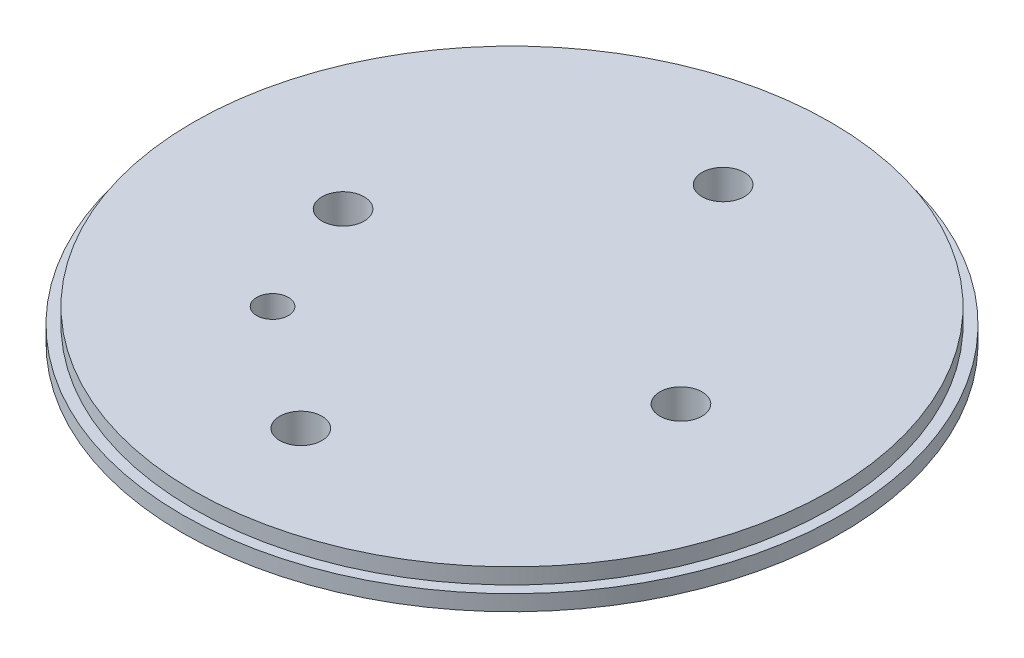
ISO-10303-21;
HEADER;
FILE_DESCRIPTION(('STEP AP214'),'2;1');
FILE_NAME('part.step','',(''),(''),'','','');
FILE_SCHEMA(('AUTOMOTIVE_DESIGN { 1 0 10303 214 1 1 1 1 }'));
ENDSEC;
DATA;
#1=APPLICATION_CONTEXT('core data for automotive mechanical design processes');
#2=APPLICATION_PROTOCOL_DEFINITION('international standard','automotive_design',2000,#1);
#3=PRODUCT_CONTEXT('',#1,'mechanical');
#4=PRODUCT('Part','Part','',(#3));
#5=PRODUCT_RELATED_PRODUCT_CATEGORY('part','',(#4));
#6=PRODUCT_DEFINITION_FORMATION('','',#4);
#7=PRODUCT_DEFINITION_CONTEXT('part definition',#1,'design');
#8=PRODUCT_DEFINITION('design','',#6,#7);
#9=PRODUCT_DEFINITION_SHAPE('','',#8);
#10=(LENGTH_UNIT() NAMED_UNIT(*) SI_UNIT(.MILLI.,.METRE.));
#11=(NAMED_UNIT(*) PLANE_ANGLE_UNIT() SI_UNIT($,.RADIAN.));
#12=(NAMED_UNIT(*) SI_UNIT($,.STERADIAN.) SOLID_ANGLE_UNIT());
#13=UNCERTAINTY_MEASURE_WITH_UNIT(LENGTH_MEASURE(1.E-05),#10,'distance_accuracy_value','');
#14=(GEOMETRIC_REPRESENTATION_CONTEXT(3) GLOBAL_UNCERTAINTY_ASSIGNED_CONTEXT((#13)) GLOBAL_UNIT_ASSIGNED_CONTEXT((#10,
#11,#12)) REPRESENTATION_CONTEXT('',''));
#15=CARTESIAN_POINT('',(0.,0.,0.));
#16=DIRECTION('',(0.,0.,1.));
#17=DIRECTION('',(1.,0.,0.));
#18=AXIS2_PLACEMENT_3D('',#15,#16,#17);
#19=CARTESIAN_POINT('',(0.,2.36,0.));
#20=DIRECTION('',(0.,-1.,0.));
#21=DIRECTION('',(0.,0.,-1.));
#22=AXIS2_PLACEMENT_3D('',#19,#20,#21);
#23=CYLINDRICAL_SURFACE('',#22,49.55);
#24=CARTESIAN_POINT('',(0.,2.36,0.));
#25=DIRECTION('',(0.,1.,0.));
#26=DIRECTION('',(0.,0.,1.));
#27=AXIS2_PLACEMENT_3D('',#24,#25,#26);
#28=CIRCLE('',#27,49.55);
#29=CARTESIAN_POINT('',(0.,2.36,49.55));
#30=VERTEX_POINT('',#29);
#31=EDGE_CURVE('E39',#30,#30,#28,.T.);
#32=ORIENTED_EDGE('',*,*,#31,.F.);
#33=EDGE_LOOP('',(#32));
#34=FACE_BOUND('',#33,.T.);
#35=CARTESIAN_POINT('',(0.,0.,0.));
#36=DIRECTION('',(0.,1.,0.));
#37=DIRECTION('',(0.,0.,1.));
#38=AXIS2_PLACEMENT_3D('',#35,#36,#37);
#39=CIRCLE('',#38,49.55);
#40=CARTESIAN_POINT('',(0.,0.,49.55));
#41=VERTEX_POINT('',#40);
#42=EDGE_CURVE('E35',#41,#41,#39,.T.);
#43=ORIENTED_EDGE('',*,*,#42,.T.);
#44=EDGE_LOOP('',(#43));
#45=FACE_BOUND('',#44,.T.);
#46=ADVANCED_FACE('F32',(#34,#45),#23,.T.);
#47=CARTESIAN_POINT('',(0.,2.36,0.));
#48=DIRECTION('',(0.,1.,0.));
#49=DIRECTION('',(0.,0.,1.));
#50=AXIS2_PLACEMENT_3D('',#47,#48,#49);
#51=PLANE('',#50);
#52=CARTESIAN_POINT('',(0.,2.36,0.));
#53=DIRECTION('',(0.,1.,0.));
#54=DIRECTION('',(0.,0.,1.));
#55=AXIS2_PLACEMENT_3D('',#52,#53,#54);
#56=CIRCLE('',#55,47.95);
#57=CARTESIAN_POINT('',(0.,2.36,47.95));
#58=VERTEX_POINT('',#57);
#59=EDGE_CURVE('E10',#58,#58,#56,.T.);
#60=ORIENTED_EDGE('',*,*,#59,.F.);
#61=EDGE_LOOP('',(#60));
#62=FACE_BOUND('',#61,.T.);
#63=ORIENTED_EDGE('',*,*,#31,.T.);
#64=EDGE_LOOP('',(#63));
#65=FACE_BOUND('',#64,.T.);
#66=ADVANCED_FACE('F93',(#62,#65),#51,.T.);
#67=CARTESIAN_POINT('',(0.,0.,0.));
#68=DIRECTION('',(0.,1.,0.));
#69=DIRECTION('',(0.,0.,1.));
#70=AXIS2_PLACEMENT_3D('',#67,#68,#69);
#71=PLANE('',#70);
#72=CARTESIAN_POINT('',(25.4,0.,0.));
#73=DIRECTION('',(0.,-1.,0.));
#74=DIRECTION('',(0.,0.,-1.));
#75=AXIS2_PLACEMENT_3D('',#72,#73,#74);
#76=CIRCLE('',#75,3.17500000000001);
#77=CARTESIAN_POINT('',(25.4,0.,-3.17500000000001));
#78=VERTEX_POINT('',#77);
#79=EDGE_CURVE('E62',#78,#78,#76,.T.);
#80=ORIENTED_EDGE('',*,*,#79,.F.);
#81=EDGE_LOOP('',(#80));
#82=FACE_BOUND('',#81,.T.);
#83=CARTESIAN_POINT('',(-18.,0.,18.));
#84=DIRECTION('',(0.,-1.,0.));
#85=DIRECTION('',(0.,0.,-1.));
#86=AXIS2_PLACEMENT_3D('',#83,#84,#85);
#87=CIRCLE('',#86,2.38);
#88=CARTESIAN_POINT('',(-18.,0.,15.62));
#89=VERTEX_POINT('',#88);
#90=EDGE_CURVE('E63',#89,#89,#87,.T.);
#91=ORIENTED_EDGE('',*,*,#90,.F.);
#92=EDGE_LOOP('',(#91));
#93=FACE_BOUND('',#92,.T.);
#94=CARTESIAN_POINT('',(0.,0.,-31.75));
#95=DIRECTION('',(0.,-1.,0.));
#96=DIRECTION('',(0.,0.,-1.));
#97=AXIS2_PLACEMENT_3D('',#94,#95,#96);
#98=CIRCLE('',#97,3.175);
#99=CARTESIAN_POINT('',(0.,0.,-34.925));
#100=VERTEX_POINT('',#99);
#101=EDGE_CURVE('E69',#100,#100,#98,.T.);
#102=ORIENTED_EDGE('',*,*,#101,.F.);
#103=EDGE_LOOP('',(#102));
#104=FACE_BOUND('',#103,.T.);
#105=CARTESIAN_POINT('',(0.,0.,31.75));
#106=DIRECTION('',(0.,-1.,0.));
#107=DIRECTION('',(0.,0.,-1.));
#108=AXIS2_PLACEMENT_3D('',#105,#106,#107);
#109=CIRCLE('',#108,3.175);
#110=CARTESIAN_POINT('',(0.,0.,28.575));
#111=VERTEX_POINT('',#110);
#112=EDGE_CURVE('E49',#111,#111,#109,.T.);
#113=ORIENTED_EDGE('',*,*,#112,.F.);
#114=EDGE_LOOP('',(#113));
#115=FACE_BOUND('',#114,.T.);
#116=CARTESIAN_POINT('',(-25.4,0.,0.));
#117=DIRECTION('',(0.,-1.,0.));
#118=DIRECTION('',(0.,0.,-1.));
#119=AXIS2_PLACEMENT_3D('',#116,#117,#118);
#120=CIRCLE('',#119,3.175);
#121=CARTESIAN_POINT('',(-25.4,0.,-3.175));
#122=VERTEX_POINT('',#121);
#123=EDGE_CURVE('E56',#122,#122,#120,.T.);
#124=ORIENTED_EDGE('',*,*,#123,.F.);
#125=EDGE_LOOP('',(#124));
#126=FACE_BOUND('',#125,.T.);
#127=ORIENTED_EDGE('',*,*,#42,.F.);
#128=EDGE_LOOP('',(#127));
#129=FACE_BOUND('',#128,.T.);
#130=ADVANCED_FACE('F89',(#82,#93,#104,#115,#126,#129),#71,.F.);
#131=CARTESIAN_POINT('',(0.,4.72,0.));
#132=DIRECTION('',(0.,-1.,0.));
#133=DIRECTION('',(0.,0.,-1.));
#134=AXIS2_PLACEMENT_3D('',#131,#132,#133);
#135=CYLINDRICAL_SURFACE('',#134,47.95);
#136=CARTESIAN_POINT('',(0.,4.72,0.));
#137=DIRECTION('',(0.,1.,0.));
#138=DIRECTION('',(0.,0.,1.));
#139=AXIS2_PLACEMENT_3D('',#136,#137,#138);
#140=CIRCLE('',#139,47.95);
#141=CARTESIAN_POINT('',(0.,4.72,47.95));
#142=VERTEX_POINT('',#141);
#143=EDGE_CURVE('E45',#142,#142,#140,.T.);
#144=ORIENTED_EDGE('',*,*,#143,.F.);
#145=EDGE_LOOP('',(#144));
#146=FACE_BOUND('',#145,.T.);
#147=ORIENTED_EDGE('',*,*,#59,.T.);
#148=EDGE_LOOP('',(#147));
#149=FACE_BOUND('',#148,.T.);
#150=ADVANCED_FACE('F92',(#146,#149),#135,.T.);
#151=CARTESIAN_POINT('',(0.,4.72,0.));
#152=DIRECTION('',(0.,1.,0.));
#153=DIRECTION('',(0.,0.,1.));
#154=AXIS2_PLACEMENT_3D('',#151,#152,#153);
#155=PLANE('',#154);
#156=CARTESIAN_POINT('',(25.4,4.72,0.));
#157=DIRECTION('',(0.,-1.,0.));
#158=DIRECTION('',(0.,0.,-1.));
#159=AXIS2_PLACEMENT_3D('',#156,#157,#158);
#160=CIRCLE('',#159,3.17500000000001);
#161=CARTESIAN_POINT('',(25.4,4.72,-3.17500000000001));
#162=VERTEX_POINT('',#161);
#163=EDGE_CURVE('E48',#162,#162,#160,.T.);
#164=ORIENTED_EDGE('',*,*,#163,.T.);
#165=EDGE_LOOP('',(#164));
#166=FACE_BOUND('',#165,.T.);
#167=CARTESIAN_POINT('',(-18.,4.72,18.));
#168=DIRECTION('',(0.,-1.,0.));
#169=DIRECTION('',(0.,0.,-1.));
#170=AXIS2_PLACEMENT_3D('',#167,#168,#169);
#171=CIRCLE('',#170,2.38);
#172=CARTESIAN_POINT('',(-18.,4.72,15.62));
#173=VERTEX_POINT('',#172);
#174=EDGE_CURVE('E66',#173,#173,#171,.T.);
#175=ORIENTED_EDGE('',*,*,#174,.T.);
#176=EDGE_LOOP('',(#175));
#177=FACE_BOUND('',#176,.T.);
#178=CARTESIAN_POINT('',(0.,4.72,-31.75));
#179=DIRECTION('',(0.,-1.,0.));
#180=DIRECTION('',(0.,0.,-1.));
#181=AXIS2_PLACEMENT_3D('',#178,#179,#180);
#182=CIRCLE('',#181,3.175);
#183=CARTESIAN_POINT('',(0.,4.72,-34.925));
#184=VERTEX_POINT('',#183);
#185=EDGE_CURVE('E53',#184,#184,#182,.T.);
#186=ORIENTED_EDGE('',*,*,#185,.T.);
#187=EDGE_LOOP('',(#186));
#188=FACE_BOUND('',#187,.T.);
#189=CARTESIAN_POINT('',(0.,4.72,31.75));
#190=DIRECTION('',(0.,-1.,0.));
#191=DIRECTION('',(0.,0.,-1.));
#192=AXIS2_PLACEMENT_3D('',#189,#190,#191);
#193=CIRCLE('',#192,3.175);
#194=CARTESIAN_POINT('',(0.,4.72,28.575));
#195=VERTEX_POINT('',#194);
#196=EDGE_CURVE('E52',#195,#195,#193,.T.);
#197=ORIENTED_EDGE('',*,*,#196,.T.);
#198=EDGE_LOOP('',(#197));
#199=FACE_BOUND('',#198,.T.);
#200=CARTESIAN_POINT('',(-25.4,4.72,0.));
#201=DIRECTION('',(0.,-1.,0.));
#202=DIRECTION('',(0.,0.,-1.));
#203=AXIS2_PLACEMENT_3D('',#200,#201,#202);
#204=CIRCLE('',#203,3.175);
#205=CARTESIAN_POINT('',(-25.4,4.72,-3.175));
#206=VERTEX_POINT('',#205);
#207=EDGE_CURVE('E59',#206,#206,#204,.T.);
#208=ORIENTED_EDGE('',*,*,#207,.T.);
#209=EDGE_LOOP('',(#208));
#210=FACE_BOUND('',#209,.T.);
#211=ORIENTED_EDGE('',*,*,#143,.T.);
#212=EDGE_LOOP('',(#211));
#213=FACE_BOUND('',#212,.T.);
#214=ADVANCED_FACE('F79',(#166,#177,#188,#199,#210,#213),#155,.T.);
#215=CARTESIAN_POINT('',(-25.4,4.72,0.));
#216=DIRECTION('',(0.,-1.,0.));
#217=DIRECTION('',(0.,0.,-1.));
#218=AXIS2_PLACEMENT_3D('',#215,#216,#217);
#219=CYLINDRICAL_SURFACE('',#218,3.175);
#220=ORIENTED_EDGE('',*,*,#207,.F.);
#221=EDGE_LOOP('',(#220));
#222=FACE_BOUND('',#221,.T.);
#223=ORIENTED_EDGE('',*,*,#123,.T.);
#224=EDGE_LOOP('',(#223));
#225=FACE_BOUND('',#224,.T.);
#226=ADVANCED_FACE('F122',(#222,#225),#219,.F.);
#227=CARTESIAN_POINT('',(0.,4.72,31.75));
#228=DIRECTION('',(0.,-1.,0.));
#229=DIRECTION('',(0.,0.,-1.));
#230=AXIS2_PLACEMENT_3D('',#227,#228,#229);
#231=CYLINDRICAL_SURFACE('',#230,3.175);
#232=ORIENTED_EDGE('',*,*,#196,.F.);
#233=EDGE_LOOP('',(#232));
#234=FACE_BOUND('',#233,.T.);
#235=ORIENTED_EDGE('',*,*,#112,.T.);
#236=EDGE_LOOP('',(#235));
#237=FACE_BOUND('',#236,.T.);
#238=ADVANCED_FACE('F123',(#234,#237),#231,.F.);
#239=CARTESIAN_POINT('',(0.,4.72,-31.75));
#240=DIRECTION('',(0.,-1.,0.));
#241=DIRECTION('',(0.,0.,-1.));
#242=AXIS2_PLACEMENT_3D('',#239,#240,#241);
#243=CYLINDRICAL_SURFACE('',#242,3.175);
#244=ORIENTED_EDGE('',*,*,#185,.F.);
#245=EDGE_LOOP('',(#244));
#246=FACE_BOUND('',#245,.T.);
#247=ORIENTED_EDGE('',*,*,#101,.T.);
#248=EDGE_LOOP('',(#247));
#249=FACE_BOUND('',#248,.T.);
#250=ADVANCED_FACE('F126',(#246,#249),#243,.F.);
#251=CARTESIAN_POINT('',(-18.,4.72,18.));
#252=DIRECTION('',(0.,-1.,0.));
#253=DIRECTION('',(0.,0.,-1.));
#254=AXIS2_PLACEMENT_3D('',#251,#252,#253);
#255=CYLINDRICAL_SURFACE('',#254,2.38);
#256=ORIENTED_EDGE('',*,*,#174,.F.);
#257=EDGE_LOOP('',(#256));
#258=FACE_BOUND('',#257,.T.);
#259=ORIENTED_EDGE('',*,*,#90,.T.);
#260=EDGE_LOOP('',(#259));
#261=FACE_BOUND('',#260,.T.);
#262=ADVANCED_FACE('F85',(#258,#261),#255,.F.);
#263=CARTESIAN_POINT('',(25.4,4.72,0.));
#264=DIRECTION('',(0.,-1.,0.));
#265=DIRECTION('',(0.,0.,-1.));
#266=AXIS2_PLACEMENT_3D('',#263,#264,#265);
#267=CYLINDRICAL_SURFACE('',#266,3.17500000000001);
#268=ORIENTED_EDGE('',*,*,#163,.F.);
#269=EDGE_LOOP('',(#268));
#270=FACE_BOUND('',#269,.T.);
#271=ORIENTED_EDGE('',*,*,#79,.T.);
#272=EDGE_LOOP('',(#271));
#273=FACE_BOUND('',#272,.T.);
#274=ADVANCED_FACE('F82',(#270,#273),#267,.F.);
#275=CLOSED_SHELL('',(#46,#66,#130,#150,#214,#226,#238,#250,#262,#274));
#276=MANIFOLD_SOLID_BREP('B2',#275);
#277=ADVANCED_BREP_SHAPE_REPRESENTATION('',(#18,#276),#14);
#278=SHAPE_DEFINITION_REPRESENTATION(#9,#277);
ENDSEC;
END-ISO-10303-21;
